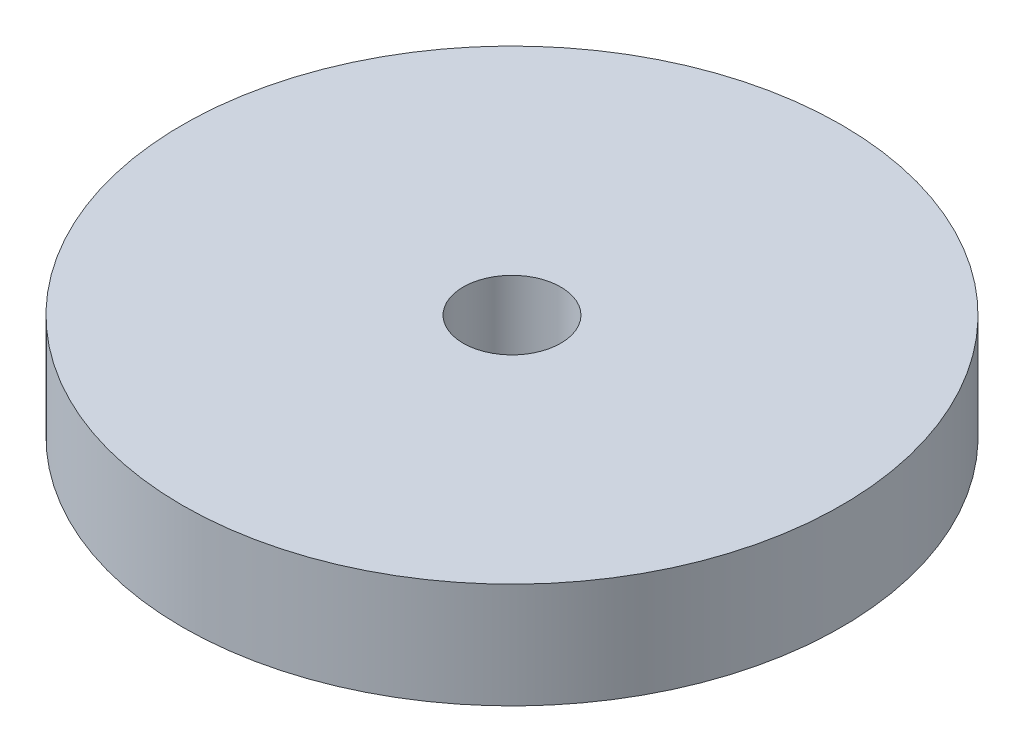
ISO-10303-21;
HEADER;
FILE_DESCRIPTION(('STEP AP214'),'2;1');
FILE_NAME('part.step','',(''),(''),'','','');
FILE_SCHEMA(('AUTOMOTIVE_DESIGN { 1 0 10303 214 1 1 1 1 }'));
ENDSEC;
DATA;
#1=APPLICATION_CONTEXT('core data for automotive mechanical design processes');
#2=APPLICATION_PROTOCOL_DEFINITION('international standard','automotive_design',2000,#1);
#3=PRODUCT_CONTEXT('',#1,'mechanical');
#4=PRODUCT('Part','Part','',(#3));
#5=PRODUCT_RELATED_PRODUCT_CATEGORY('part','',(#4));
#6=PRODUCT_DEFINITION_FORMATION('','',#4);
#7=PRODUCT_DEFINITION_CONTEXT('part definition',#1,'design');
#8=PRODUCT_DEFINITION('design','',#6,#7);
#9=PRODUCT_DEFINITION_SHAPE('','',#8);
#10=(LENGTH_UNIT() NAMED_UNIT(*) SI_UNIT(.MILLI.,.METRE.));
#11=(NAMED_UNIT(*) PLANE_ANGLE_UNIT() SI_UNIT($,.RADIAN.));
#12=(NAMED_UNIT(*) SI_UNIT($,.STERADIAN.) SOLID_ANGLE_UNIT());
#13=UNCERTAINTY_MEASURE_WITH_UNIT(LENGTH_MEASURE(1.E-05),#10,'distance_accuracy_value','');
#14=(GEOMETRIC_REPRESENTATION_CONTEXT(3) GLOBAL_UNCERTAINTY_ASSIGNED_CONTEXT((#13)) GLOBAL_UNIT_ASSIGNED_CONTEXT((#10,
#11,#12)) REPRESENTATION_CONTEXT('',''));
#15=CARTESIAN_POINT('',(0.,0.,0.));
#16=DIRECTION('',(0.,0.,1.));
#17=DIRECTION('',(1.,0.,0.));
#18=AXIS2_PLACEMENT_3D('',#15,#16,#17);
#19=CARTESIAN_POINT('',(0.,2.,0.));
#20=DIRECTION('',(0.,1.,0.));
#21=DIRECTION('',(0.,0.,1.));
#22=AXIS2_PLACEMENT_3D('',#19,#20,#21);
#23=PLANE('',#22);
#24=CARTESIAN_POINT('',(0.,2.,0.));
#25=DIRECTION('',(0.,1.,0.));
#26=DIRECTION('',(0.,0.,1.));
#27=AXIS2_PLACEMENT_3D('',#24,#25,#26);
#28=CIRCLE('',#27,12.5);
#29=CARTESIAN_POINT('',(0.,2.,12.5));
#30=VERTEX_POINT('',#29);
#31=EDGE_CURVE('E10',#30,#30,#28,.T.);
#32=ORIENTED_EDGE('',*,*,#31,.T.);
#33=EDGE_LOOP('',(#32));
#34=FACE_BOUND('',#33,.T.);
#35=CARTESIAN_POINT('',(0.,2.,0.));
#36=DIRECTION('',(0.,1.,0.));
#37=DIRECTION('',(0.,0.,1.));
#38=AXIS2_PLACEMENT_3D('',#35,#36,#37);
#39=CIRCLE('',#38,1.85);
#40=CARTESIAN_POINT('',(0.,2.,1.85));
#41=VERTEX_POINT('',#40);
#42=EDGE_CURVE('E50',#41,#41,#39,.T.);
#43=ORIENTED_EDGE('',*,*,#42,.F.);
#44=EDGE_LOOP('',(#43));
#45=FACE_BOUND('',#44,.T.);
#46=ADVANCED_FACE('F39',(#34,#45),#23,.T.);
#47=CARTESIAN_POINT('',(0.,-2.,0.));
#48=DIRECTION('',(0.,1.,0.));
#49=DIRECTION('',(0.,0.,1.));
#50=AXIS2_PLACEMENT_3D('',#47,#48,#49);
#51=PLANE('',#50);
#52=CARTESIAN_POINT('',(0.,-2.,0.));
#53=DIRECTION('',(0.,1.,0.));
#54=DIRECTION('',(0.,0.,1.));
#55=AXIS2_PLACEMENT_3D('',#52,#53,#54);
#56=CIRCLE('',#55,12.5);
#57=CARTESIAN_POINT('',(0.,-2.,12.5));
#58=VERTEX_POINT('',#57);
#59=EDGE_CURVE('E43',#58,#58,#56,.T.);
#60=ORIENTED_EDGE('',*,*,#59,.F.);
#61=EDGE_LOOP('',(#60));
#62=FACE_BOUND('',#61,.T.);
#63=CARTESIAN_POINT('',(0.,-2.,0.));
#64=DIRECTION('',(0.,1.,0.));
#65=DIRECTION('',(0.,0.,1.));
#66=AXIS2_PLACEMENT_3D('',#63,#64,#65);
#67=CIRCLE('',#66,1.85);
#68=CARTESIAN_POINT('',(0.,-2.,1.85));
#69=VERTEX_POINT('',#68);
#70=EDGE_CURVE('E52',#69,#69,#67,.T.);
#71=ORIENTED_EDGE('',*,*,#70,.T.);
#72=EDGE_LOOP('',(#71));
#73=FACE_BOUND('',#72,.T.);
#74=ADVANCED_FACE('F62',(#62,#73),#51,.F.);
#75=CARTESIAN_POINT('',(0.,2.,0.));
#76=DIRECTION('',(0.,-1.,0.));
#77=DIRECTION('',(0.,0.,-1.));
#78=AXIS2_PLACEMENT_3D('',#75,#76,#77);
#79=CYLINDRICAL_SURFACE('',#78,12.5);
#80=ORIENTED_EDGE('',*,*,#31,.F.);
#81=EDGE_LOOP('',(#80));
#82=FACE_BOUND('',#81,.T.);
#83=ORIENTED_EDGE('',*,*,#59,.T.);
#84=EDGE_LOOP('',(#83));
#85=FACE_BOUND('',#84,.T.);
#86=ADVANCED_FACE('F41',(#82,#85),#79,.T.);
#87=CARTESIAN_POINT('',(0.,2.,0.));
#88=DIRECTION('',(0.,-1.,0.));
#89=DIRECTION('',(0.,0.,-1.));
#90=AXIS2_PLACEMENT_3D('',#87,#88,#89);
#91=CYLINDRICAL_SURFACE('',#90,1.85);
#92=ORIENTED_EDGE('',*,*,#42,.T.);
#93=EDGE_LOOP('',(#92));
#94=FACE_BOUND('',#93,.T.);
#95=ORIENTED_EDGE('',*,*,#70,.F.);
#96=EDGE_LOOP('',(#95));
#97=FACE_BOUND('',#96,.T.);
#98=ADVANCED_FACE('F58',(#94,#97),#91,.F.);
#99=CLOSED_SHELL('',(#46,#74,#86,#98));
#100=MANIFOLD_SOLID_BREP('B2',#99);
#101=ADVANCED_BREP_SHAPE_REPRESENTATION('',(#18,#100),#14);
#102=SHAPE_DEFINITION_REPRESENTATION(#9,#101);
ENDSEC;
END-ISO-10303-21;
